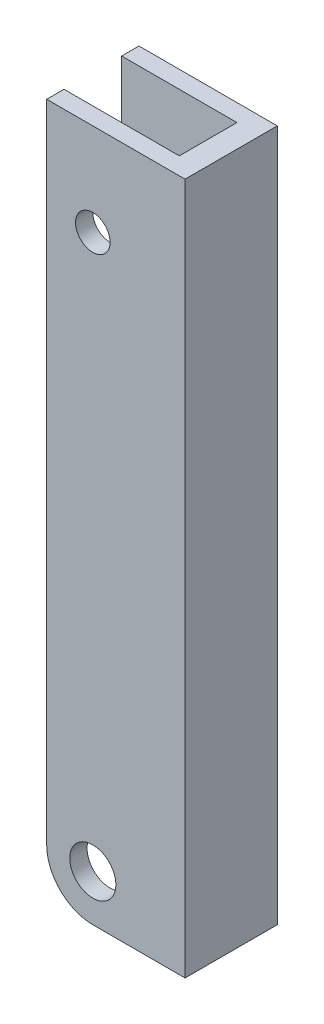
ISO-10303-21;
HEADER;
FILE_DESCRIPTION(('STEP AP214'),'2;1');
FILE_NAME('part.step','',(''),(''),'','','');
FILE_SCHEMA(('AUTOMOTIVE_DESIGN { 1 0 10303 214 1 1 1 1 }'));
ENDSEC;
DATA;
#1=APPLICATION_CONTEXT('core data for automotive mechanical design processes');
#2=APPLICATION_PROTOCOL_DEFINITION('international standard','automotive_design',2000,#1);
#3=PRODUCT_CONTEXT('',#1,'mechanical');
#4=PRODUCT('Part','Part','',(#3));
#5=PRODUCT_RELATED_PRODUCT_CATEGORY('part','',(#4));
#6=PRODUCT_DEFINITION_FORMATION('','',#4);
#7=PRODUCT_DEFINITION_CONTEXT('part definition',#1,'design');
#8=PRODUCT_DEFINITION('design','',#6,#7);
#9=PRODUCT_DEFINITION_SHAPE('','',#8);
#10=(LENGTH_UNIT() NAMED_UNIT(*) SI_UNIT(.MILLI.,.METRE.));
#11=(NAMED_UNIT(*) PLANE_ANGLE_UNIT() SI_UNIT($,.RADIAN.));
#12=(NAMED_UNIT(*) SI_UNIT($,.STERADIAN.) SOLID_ANGLE_UNIT());
#13=UNCERTAINTY_MEASURE_WITH_UNIT(LENGTH_MEASURE(1.E-05),#10,'distance_accuracy_value','');
#14=(GEOMETRIC_REPRESENTATION_CONTEXT(3) GLOBAL_UNCERTAINTY_ASSIGNED_CONTEXT((#13)) GLOBAL_UNIT_ASSIGNED_CONTEXT((#10,
#11,#12)) REPRESENTATION_CONTEXT('',''));
#15=CARTESIAN_POINT('',(0.,0.,0.));
#16=DIRECTION('',(0.,0.,1.));
#17=DIRECTION('',(1.,0.,0.));
#18=AXIS2_PLACEMENT_3D('',#15,#16,#17);
#19=CARTESIAN_POINT('',(172.039586572849,189.65869932881,6.35));
#20=DIRECTION('',(0.,0.,1.));
#21=DIRECTION('',(1.,0.,0.));
#22=AXIS2_PLACEMENT_3D('',#19,#20,#21);
#23=CYLINDRICAL_SURFACE('',#22,2.38125);
#24=CARTESIAN_POINT('',(172.039586572849,189.65869932881,-3.96875));
#25=DIRECTION('',(0.,0.,1.));
#26=DIRECTION('',(1.,0.,0.));
#27=AXIS2_PLACEMENT_3D('',#24,#25,#26);
#28=CIRCLE('',#27,2.38125);
#29=CARTESIAN_POINT('',(174.420836572849,189.65869932881,-3.96875));
#30=VERTEX_POINT('',#29);
#31=EDGE_CURVE('E91',#30,#30,#28,.T.);
#32=ORIENTED_EDGE('',*,*,#31,.T.);
#33=EDGE_LOOP('',(#32));
#34=FACE_BOUND('',#33,.T.);
#35=CARTESIAN_POINT('',(172.039586572849,189.65869932881,-6.35));
#36=DIRECTION('',(0.,0.,1.));
#37=DIRECTION('',(1.,0.,0.));
#38=AXIS2_PLACEMENT_3D('',#35,#36,#37);
#39=CIRCLE('',#38,2.38125);
#40=CARTESIAN_POINT('',(174.420836572849,189.65869932881,-6.35));
#41=VERTEX_POINT('',#40);
#42=EDGE_CURVE('E19',#41,#41,#39,.T.);
#43=ORIENTED_EDGE('',*,*,#42,.F.);
#44=EDGE_LOOP('',(#43));
#45=FACE_BOUND('',#44,.T.);
#46=ADVANCED_FACE('F16',(#34,#45),#23,.F.);
#47=CARTESIAN_POINT('',(172.039586572849,113.45869932881,-6.35));
#48=DIRECTION('',(0.,0.,-1.));
#49=DIRECTION('',(-1.,0.,0.));
#50=AXIS2_PLACEMENT_3D('',#47,#48,#49);
#51=CYLINDRICAL_SURFACE('',#50,3.17500000000001);
#52=CARTESIAN_POINT('',(172.039586572849,113.45869932881,-3.96875));
#53=DIRECTION('',(0.,0.,-1.));
#54=DIRECTION('',(-1.,0.,0.));
#55=AXIS2_PLACEMENT_3D('',#52,#53,#54);
#56=CIRCLE('',#55,3.17500000000001);
#57=CARTESIAN_POINT('',(168.864586572849,113.45869932881,-3.96875));
#58=VERTEX_POINT('',#57);
#59=EDGE_CURVE('E94',#58,#58,#56,.F.);
#60=ORIENTED_EDGE('',*,*,#59,.T.);
#61=EDGE_LOOP('',(#60));
#62=FACE_BOUND('',#61,.T.);
#63=CARTESIAN_POINT('',(172.039586572849,113.45869932881,-6.35));
#64=DIRECTION('',(0.,0.,-1.));
#65=DIRECTION('',(-1.,0.,0.));
#66=AXIS2_PLACEMENT_3D('',#63,#64,#65);
#67=CIRCLE('',#66,3.17500000000001);
#68=CARTESIAN_POINT('',(168.864586572849,113.45869932881,-6.35));
#69=VERTEX_POINT('',#68);
#70=EDGE_CURVE('E83',#69,#69,#67,.F.);
#71=ORIENTED_EDGE('',*,*,#70,.F.);
#72=EDGE_LOOP('',(#71));
#73=FACE_BOUND('',#72,.T.);
#74=ADVANCED_FACE('F104',(#62,#73),#51,.F.);
#75=CARTESIAN_POINT('',(165.689586572849,107.10869932881,6.35));
#76=DIRECTION('',(1.,0.,0.));
#77=DIRECTION('',(0.,0.,-1.));
#78=AXIS2_PLACEMENT_3D('',#75,#76,#77);
#79=PLANE('',#78);
#80=DIRECTION('',(0.,0.,-1.));
#81=VECTOR('',#80,1.);
#82=CARTESIAN_POINT('',(165.689586572849,113.45869932881,6.35));
#83=LINE('',#82,#81);
#84=CARTESIAN_POINT('',(165.689586572849,113.45869932881,-3.96875));
#85=VERTEX_POINT('',#84);
#86=CARTESIAN_POINT('',(165.689586572849,113.45869932881,-6.35));
#87=VERTEX_POINT('',#86);
#88=EDGE_CURVE('E61',#85,#87,#83,.T.);
#89=ORIENTED_EDGE('',*,*,#88,.F.);
#90=DIRECTION('',(0.,1.,0.));
#91=VECTOR('',#90,1.);
#92=CARTESIAN_POINT('',(165.689586572849,202.35869932881,-3.96875));
#93=LINE('',#92,#91);
#94=CARTESIAN_POINT('',(165.689586572849,202.35869932881,-3.96875));
#95=VERTEX_POINT('',#94);
#96=EDGE_CURVE('E273',#85,#95,#93,.T.);
#97=ORIENTED_EDGE('',*,*,#96,.T.);
#98=DIRECTION('',(0.,0.,-1.));
#99=VECTOR('',#98,1.);
#100=CARTESIAN_POINT('',(165.689586572849,202.35869932881,6.35));
#101=LINE('',#100,#99);
#102=CARTESIAN_POINT('',(165.689586572849,202.35869932881,-6.35));
#103=VERTEX_POINT('',#102);
#104=EDGE_CURVE('E79',#95,#103,#101,.T.);
#105=ORIENTED_EDGE('',*,*,#104,.T.);
#106=DIRECTION('',(0.,1.,0.));
#107=VECTOR('',#106,1.);
#108=CARTESIAN_POINT('',(165.689586572849,0.,-6.35));
#109=LINE('',#108,#107);
#110=EDGE_CURVE('E72',#87,#103,#109,.T.);
#111=ORIENTED_EDGE('',*,*,#110,.F.);
#112=EDGE_LOOP('',(#89,#97,#105,#111));
#113=FACE_BOUND('',#112,.T.);
#114=ADVANCED_FACE('F76',(#113),#79,.F.);
#115=CARTESIAN_POINT('',(0.,0.,-6.35));
#116=DIRECTION('',(0.,0.,-1.));
#117=DIRECTION('',(-1.,0.,0.));
#118=AXIS2_PLACEMENT_3D('',#115,#116,#117);
#119=PLANE('',#118);
#120=DIRECTION('',(1.,0.,0.));
#121=VECTOR('',#120,1.);
#122=CARTESIAN_POINT('',(165.689586572849,202.35869932881,-6.35));
#123=LINE('',#122,#121);
#124=CARTESIAN_POINT('',(184.739586572849,202.35869932881,-6.35));
#125=VERTEX_POINT('',#124);
#126=EDGE_CURVE('E306',#103,#125,#123,.T.);
#127=ORIENTED_EDGE('',*,*,#126,.T.);
#128=DIRECTION('',(0.,1.,0.));
#129=VECTOR('',#128,1.);
#130=CARTESIAN_POINT('',(184.739586572849,107.10869932881,-6.35));
#131=LINE('',#130,#129);
#132=CARTESIAN_POINT('',(184.739586572849,107.10869932881,-6.35));
#133=VERTEX_POINT('',#132);
#134=EDGE_CURVE('E319',#125,#133,#131,.F.);
#135=ORIENTED_EDGE('',*,*,#134,.T.);
#136=DIRECTION('',(1.,0.,0.));
#137=VECTOR('',#136,1.);
#138=CARTESIAN_POINT('',(165.689586572849,107.10869932881,-6.35));
#139=LINE('',#138,#137);
#140=CARTESIAN_POINT('',(172.039586572849,107.10869932881,-6.35));
#141=VERTEX_POINT('',#140);
#142=EDGE_CURVE('E90',#133,#141,#139,.F.);
#143=ORIENTED_EDGE('',*,*,#142,.T.);
#144=CARTESIAN_POINT('',(172.039586572849,113.45869932881,-6.35));
#145=DIRECTION('',(0.,0.,-1.));
#146=DIRECTION('',(-1.,0.,0.));
#147=AXIS2_PLACEMENT_3D('',#144,#145,#146);
#148=CIRCLE('',#147,6.34999999999999);
#149=EDGE_CURVE('E66',#87,#141,#148,.F.);
#150=ORIENTED_EDGE('',*,*,#149,.F.);
#151=ORIENTED_EDGE('',*,*,#110,.T.);
#152=EDGE_LOOP('',(#127,#135,#143,#150,#151));
#153=FACE_BOUND('',#152,.T.);
#154=ORIENTED_EDGE('',*,*,#70,.T.);
#155=EDGE_LOOP('',(#154));
#156=FACE_BOUND('',#155,.T.);
#157=ORIENTED_EDGE('',*,*,#42,.T.);
#158=EDGE_LOOP('',(#157));
#159=FACE_BOUND('',#158,.T.);
#160=ADVANCED_FACE('F86',(#153,#156,#159),#119,.T.);
#161=CARTESIAN_POINT('',(172.039586572849,113.45869932881,6.35));
#162=DIRECTION('',(0.,0.,-1.));
#163=DIRECTION('',(-1.,0.,0.));
#164=AXIS2_PLACEMENT_3D('',#161,#162,#163);
#165=CYLINDRICAL_SURFACE('',#164,6.34999999999999);
#166=ORIENTED_EDGE('',*,*,#149,.T.);
#167=DIRECTION('',(0.,0.,1.));
#168=VECTOR('',#167,1.);
#169=CARTESIAN_POINT('',(172.039586572849,107.10869932881,6.35));
#170=LINE('',#169,#168);
#171=CARTESIAN_POINT('',(172.039586572849,107.10869932881,-3.96875));
#172=VERTEX_POINT('',#171);
#173=EDGE_CURVE('E327',#141,#172,#170,.T.);
#174=ORIENTED_EDGE('',*,*,#173,.T.);
#175=CARTESIAN_POINT('',(172.039586572849,113.45869932881,-3.96875));
#176=DIRECTION('',(0.,0.,-1.));
#177=DIRECTION('',(-1.,0.,0.));
#178=AXIS2_PLACEMENT_3D('',#175,#176,#177);
#179=CIRCLE('',#178,6.34999999999999);
#180=EDGE_CURVE('E68',#172,#85,#179,.T.);
#181=ORIENTED_EDGE('',*,*,#180,.T.);
#182=ORIENTED_EDGE('',*,*,#88,.T.);
#183=EDGE_LOOP('',(#166,#174,#181,#182));
#184=FACE_BOUND('',#183,.T.);
#185=ADVANCED_FACE('F63',(#184),#165,.T.);
#186=CARTESIAN_POINT('',(165.689586572849,202.35869932881,-3.96875));
#187=DIRECTION('',(0.,0.,-1.));
#188=DIRECTION('',(-1.,0.,0.));
#189=AXIS2_PLACEMENT_3D('',#186,#187,#188);
#190=PLANE('',#189);
#191=ORIENTED_EDGE('',*,*,#180,.F.);
#192=DIRECTION('',(1.,0.,0.));
#193=VECTOR('',#192,1.);
#194=CARTESIAN_POINT('',(165.689586572849,107.10869932881,-3.96875));
#195=LINE('',#194,#193);
#196=CARTESIAN_POINT('',(181.564586572849,107.10869932881,-3.96875));
#197=VERTEX_POINT('',#196);
#198=EDGE_CURVE('E329',#172,#197,#195,.T.);
#199=ORIENTED_EDGE('',*,*,#198,.T.);
#200=DIRECTION('',(0.,1.,0.));
#201=VECTOR('',#200,1.);
#202=CARTESIAN_POINT('',(181.564586572849,202.35869932881,-3.96875));
#203=LINE('',#202,#201);
#204=CARTESIAN_POINT('',(181.564586572849,202.35869932881,-3.96875));
#205=VERTEX_POINT('',#204);
#206=EDGE_CURVE('E333',#197,#205,#203,.T.);
#207=ORIENTED_EDGE('',*,*,#206,.T.);
#208=DIRECTION('',(1.,0.,0.));
#209=VECTOR('',#208,1.);
#210=CARTESIAN_POINT('',(165.689586572849,202.35869932881,-3.96875));
#211=LINE('',#210,#209);
#212=EDGE_CURVE('E283',#205,#95,#211,.F.);
#213=ORIENTED_EDGE('',*,*,#212,.T.);
#214=ORIENTED_EDGE('',*,*,#96,.F.);
#215=EDGE_LOOP('',(#191,#199,#207,#213,#214));
#216=FACE_BOUND('',#215,.T.);
#217=ORIENTED_EDGE('',*,*,#59,.F.);
#218=EDGE_LOOP('',(#217));
#219=FACE_BOUND('',#218,.T.);
#220=ORIENTED_EDGE('',*,*,#31,.F.);
#221=EDGE_LOOP('',(#220));
#222=FACE_BOUND('',#221,.T.);
#223=ADVANCED_FACE('F155',(#216,#219,#222),#190,.F.);
#224=CARTESIAN_POINT('',(181.564586572849,202.35869932881,-3.96875));
#225=DIRECTION('',(1.,0.,0.));
#226=DIRECTION('',(0.,0.,-1.));
#227=AXIS2_PLACEMENT_3D('',#224,#225,#226);
#228=PLANE('',#227);
#229=DIRECTION('',(0.,1.,0.));
#230=VECTOR('',#229,1.);
#231=CARTESIAN_POINT('',(181.564586572849,202.35869932881,3.96875));
#232=LINE('',#231,#230);
#233=CARTESIAN_POINT('',(181.564586572849,107.10869932881,3.96875));
#234=VERTEX_POINT('',#233);
#235=CARTESIAN_POINT('',(181.564586572849,202.35869932881,3.96875));
#236=VERTEX_POINT('',#235);
#237=EDGE_CURVE('E280',#234,#236,#232,.T.);
#238=ORIENTED_EDGE('',*,*,#237,.T.);
#239=DIRECTION('',(0.,0.,-1.));
#240=VECTOR('',#239,1.);
#241=CARTESIAN_POINT('',(181.564586572849,202.35869932881,6.35));
#242=LINE('',#241,#240);
#243=EDGE_CURVE('E309',#236,#205,#242,.T.);
#244=ORIENTED_EDGE('',*,*,#243,.T.);
#245=ORIENTED_EDGE('',*,*,#206,.F.);
#246=DIRECTION('',(0.,0.,1.));
#247=VECTOR('',#246,1.);
#248=CARTESIAN_POINT('',(181.564586572849,107.10869932881,6.35));
#249=LINE('',#248,#247);
#250=EDGE_CURVE('E337',#197,#234,#249,.T.);
#251=ORIENTED_EDGE('',*,*,#250,.T.);
#252=EDGE_LOOP('',(#238,#244,#245,#251));
#253=FACE_BOUND('',#252,.T.);
#254=ADVANCED_FACE('F151',(#253),#228,.F.);
#255=CARTESIAN_POINT('',(165.689586572849,202.35869932881,3.96875));
#256=DIRECTION('',(0.,0.,1.));
#257=DIRECTION('',(1.,0.,0.));
#258=AXIS2_PLACEMENT_3D('',#255,#256,#257);
#259=PLANE('',#258);
#260=CARTESIAN_POINT('',(172.039586572849,113.45869932881,3.96875));
#261=DIRECTION('',(0.,0.,-1.));
#262=DIRECTION('',(-1.,0.,0.));
#263=AXIS2_PLACEMENT_3D('',#260,#261,#262);
#264=CIRCLE('',#263,6.34999999999999);
#265=CARTESIAN_POINT('',(165.689586572849,113.45869932881,3.96875));
#266=VERTEX_POINT('',#265);
#267=CARTESIAN_POINT('',(172.039586572849,107.10869932881,3.96875));
#268=VERTEX_POINT('',#267);
#269=EDGE_CURVE('E284',#266,#268,#264,.F.);
#270=ORIENTED_EDGE('',*,*,#269,.F.);
#271=DIRECTION('',(0.,1.,0.));
#272=VECTOR('',#271,1.);
#273=CARTESIAN_POINT('',(165.689586572849,107.10869932881,3.96875));
#274=LINE('',#273,#272);
#275=CARTESIAN_POINT('',(165.689586572849,202.35869932881,3.96875));
#276=VERTEX_POINT('',#275);
#277=EDGE_CURVE('E292',#266,#276,#274,.T.);
#278=ORIENTED_EDGE('',*,*,#277,.T.);
#279=DIRECTION('',(1.,0.,0.));
#280=VECTOR('',#279,1.);
#281=CARTESIAN_POINT('',(165.689586572849,202.35869932881,3.96875));
#282=LINE('',#281,#280);
#283=EDGE_CURVE('E313',#276,#236,#282,.T.);
#284=ORIENTED_EDGE('',*,*,#283,.T.);
#285=ORIENTED_EDGE('',*,*,#237,.F.);
#286=DIRECTION('',(1.,0.,0.));
#287=VECTOR('',#286,1.);
#288=CARTESIAN_POINT('',(165.689586572849,107.10869932881,3.96875));
#289=LINE('',#288,#287);
#290=EDGE_CURVE('E287',#234,#268,#289,.F.);
#291=ORIENTED_EDGE('',*,*,#290,.T.);
#292=EDGE_LOOP('',(#270,#278,#284,#285,#291));
#293=FACE_BOUND('',#292,.T.);
#294=CARTESIAN_POINT('',(172.039586572849,113.45869932881,3.96875));
#295=DIRECTION('',(0.,0.,-1.));
#296=DIRECTION('',(-1.,0.,0.));
#297=AXIS2_PLACEMENT_3D('',#294,#295,#296);
#298=CIRCLE('',#297,3.17500000000001);
#299=CARTESIAN_POINT('',(168.864586572849,113.45869932881,3.96875));
#300=VERTEX_POINT('',#299);
#301=EDGE_CURVE('E279',#300,#300,#298,.F.);
#302=ORIENTED_EDGE('',*,*,#301,.T.);
#303=EDGE_LOOP('',(#302));
#304=FACE_BOUND('',#303,.T.);
#305=CARTESIAN_POINT('',(172.039586572849,189.65869932881,3.96875));
#306=DIRECTION('',(0.,0.,1.));
#307=DIRECTION('',(1.,0.,0.));
#308=AXIS2_PLACEMENT_3D('',#305,#306,#307);
#309=CIRCLE('',#308,2.38125);
#310=CARTESIAN_POINT('',(174.420836572849,189.65869932881,3.96875));
#311=VERTEX_POINT('',#310);
#312=EDGE_CURVE('E276',#311,#311,#309,.T.);
#313=ORIENTED_EDGE('',*,*,#312,.T.);
#314=EDGE_LOOP('',(#313));
#315=FACE_BOUND('',#314,.T.);
#316=ADVANCED_FACE('F147',(#293,#304,#315),#259,.F.);
#317=CARTESIAN_POINT('',(172.039586572849,189.65869932881,6.35));
#318=DIRECTION('',(0.,0.,1.));
#319=DIRECTION('',(1.,0.,0.));
#320=AXIS2_PLACEMENT_3D('',#317,#318,#319);
#321=CYLINDRICAL_SURFACE('',#320,2.38125);
#322=ORIENTED_EDGE('',*,*,#312,.F.);
#323=EDGE_LOOP('',(#322));
#324=FACE_BOUND('',#323,.T.);
#325=CARTESIAN_POINT('',(172.039586572849,189.65869932881,6.35));
#326=DIRECTION('',(0.,0.,1.));
#327=DIRECTION('',(1.,0.,0.));
#328=AXIS2_PLACEMENT_3D('',#325,#326,#327);
#329=CIRCLE('',#328,2.38125);
#330=CARTESIAN_POINT('',(174.420836572849,189.65869932881,6.35));
#331=VERTEX_POINT('',#330);
#332=EDGE_CURVE('E288',#331,#331,#329,.T.);
#333=ORIENTED_EDGE('',*,*,#332,.T.);
#334=EDGE_LOOP('',(#333));
#335=FACE_BOUND('',#334,.T.);
#336=ADVANCED_FACE('F143',(#324,#335),#321,.F.);
#337=CARTESIAN_POINT('',(172.039586572849,113.45869932881,-6.35));
#338=DIRECTION('',(0.,0.,-1.));
#339=DIRECTION('',(-1.,0.,0.));
#340=AXIS2_PLACEMENT_3D('',#337,#338,#339);
#341=CYLINDRICAL_SURFACE('',#340,3.17500000000001);
#342=CARTESIAN_POINT('',(172.039586572849,113.45869932881,6.35));
#343=DIRECTION('',(0.,0.,-1.));
#344=DIRECTION('',(-1.,0.,0.));
#345=AXIS2_PLACEMENT_3D('',#342,#343,#344);
#346=CIRCLE('',#345,3.17500000000001);
#347=CARTESIAN_POINT('',(168.864586572849,113.45869932881,6.35));
#348=VERTEX_POINT('',#347);
#349=EDGE_CURVE('E291',#348,#348,#346,.F.);
#350=ORIENTED_EDGE('',*,*,#349,.T.);
#351=EDGE_LOOP('',(#350));
#352=FACE_BOUND('',#351,.T.);
#353=ORIENTED_EDGE('',*,*,#301,.F.);
#354=EDGE_LOOP('',(#353));
#355=FACE_BOUND('',#354,.T.);
#356=ADVANCED_FACE('F139',(#352,#355),#341,.F.);
#357=CARTESIAN_POINT('',(165.689586572849,202.35869932881,6.35));
#358=DIRECTION('',(0.,-1.,0.));
#359=DIRECTION('',(0.,0.,-1.));
#360=AXIS2_PLACEMENT_3D('',#357,#358,#359);
#361=PLANE('',#360);
#362=ORIENTED_EDGE('',*,*,#283,.F.);
#363=DIRECTION('',(0.,0.,-1.));
#364=VECTOR('',#363,1.);
#365=CARTESIAN_POINT('',(165.689586572849,202.35869932881,6.35));
#366=LINE('',#365,#364);
#367=CARTESIAN_POINT('',(165.689586572849,202.35869932881,6.35));
#368=VERTEX_POINT('',#367);
#369=EDGE_CURVE('E376',#276,#368,#366,.F.);
#370=ORIENTED_EDGE('',*,*,#369,.T.);
#371=DIRECTION('',(-1.,0.,0.));
#372=VECTOR('',#371,1.);
#373=CARTESIAN_POINT('',(0.,202.35869932881,6.35));
#374=LINE('',#373,#372);
#375=CARTESIAN_POINT('',(184.739586572849,202.35869932881,6.35));
#376=VERTEX_POINT('',#375);
#377=EDGE_CURVE('E295',#368,#376,#374,.F.);
#378=ORIENTED_EDGE('',*,*,#377,.T.);
#379=DIRECTION('',(0.,0.,1.));
#380=VECTOR('',#379,1.);
#381=CARTESIAN_POINT('',(184.739586572849,202.35869932881,6.35));
#382=LINE('',#381,#380);
#383=EDGE_CURVE('E312',#376,#125,#382,.F.);
#384=ORIENTED_EDGE('',*,*,#383,.T.);
#385=ORIENTED_EDGE('',*,*,#126,.F.);
#386=ORIENTED_EDGE('',*,*,#104,.F.);
#387=ORIENTED_EDGE('',*,*,#212,.F.);
#388=ORIENTED_EDGE('',*,*,#243,.F.);
#389=EDGE_LOOP('',(#362,#370,#378,#384,#385,#386,#387,#388));
#390=FACE_BOUND('',#389,.T.);
#391=ADVANCED_FACE('F135',(#390),#361,.F.);
#392=CARTESIAN_POINT('',(184.739586572849,107.10869932881,6.35));
#393=DIRECTION('',(-1.,0.,0.));
#394=DIRECTION('',(0.,0.,1.));
#395=AXIS2_PLACEMENT_3D('',#392,#393,#394);
#396=PLANE('',#395);
#397=ORIENTED_EDGE('',*,*,#383,.F.);
#398=DIRECTION('',(0.,1.,0.));
#399=VECTOR('',#398,1.);
#400=CARTESIAN_POINT('',(184.739586572849,0.,6.35));
#401=LINE('',#400,#399);
#402=CARTESIAN_POINT('',(184.739586572849,107.10869932881,6.35));
#403=VERTEX_POINT('',#402);
#404=EDGE_CURVE('E368',#376,#403,#401,.F.);
#405=ORIENTED_EDGE('',*,*,#404,.T.);
#406=DIRECTION('',(0.,0.,1.));
#407=VECTOR('',#406,1.);
#408=CARTESIAN_POINT('',(184.739586572849,107.10869932881,6.35));
#409=LINE('',#408,#407);
#410=EDGE_CURVE('E321',#403,#133,#409,.F.);
#411=ORIENTED_EDGE('',*,*,#410,.T.);
#412=ORIENTED_EDGE('',*,*,#134,.F.);
#413=EDGE_LOOP('',(#397,#405,#411,#412));
#414=FACE_BOUND('',#413,.T.);
#415=ADVANCED_FACE('F131',(#414),#396,.F.);
#416=CARTESIAN_POINT('',(165.689586572849,107.10869932881,6.35));
#417=DIRECTION('',(0.,1.,0.));
#418=DIRECTION('',(0.,0.,1.));
#419=AXIS2_PLACEMENT_3D('',#416,#417,#418);
#420=PLANE('',#419);
#421=DIRECTION('',(0.,0.,-1.));
#422=VECTOR('',#421,1.);
#423=CARTESIAN_POINT('',(172.039586572849,107.10869932881,6.35));
#424=LINE('',#423,#422);
#425=CARTESIAN_POINT('',(172.039586572849,107.10869932881,6.35));
#426=VERTEX_POINT('',#425);
#427=EDGE_CURVE('E286',#268,#426,#424,.F.);
#428=ORIENTED_EDGE('',*,*,#427,.F.);
#429=ORIENTED_EDGE('',*,*,#290,.F.);
#430=ORIENTED_EDGE('',*,*,#250,.F.);
#431=ORIENTED_EDGE('',*,*,#198,.F.);
#432=ORIENTED_EDGE('',*,*,#173,.F.);
#433=ORIENTED_EDGE('',*,*,#142,.F.);
#434=ORIENTED_EDGE('',*,*,#410,.F.);
#435=DIRECTION('',(-1.,0.,0.));
#436=VECTOR('',#435,1.);
#437=CARTESIAN_POINT('',(0.,107.10869932881,6.35));
#438=LINE('',#437,#436);
#439=EDGE_CURVE('E297',#403,#426,#438,.T.);
#440=ORIENTED_EDGE('',*,*,#439,.T.);
#441=EDGE_LOOP('',(#428,#429,#430,#431,#432,#433,#434,#440));
#442=FACE_BOUND('',#441,.T.);
#443=ADVANCED_FACE('F127',(#442),#420,.F.);
#444=CARTESIAN_POINT('',(172.039586572849,113.45869932881,6.35));
#445=DIRECTION('',(0.,0.,-1.));
#446=DIRECTION('',(-1.,0.,0.));
#447=AXIS2_PLACEMENT_3D('',#444,#445,#446);
#448=CYLINDRICAL_SURFACE('',#447,6.34999999999999);
#449=ORIENTED_EDGE('',*,*,#269,.T.);
#450=ORIENTED_EDGE('',*,*,#427,.T.);
#451=CARTESIAN_POINT('',(172.039586572849,113.45869932881,6.35));
#452=DIRECTION('',(0.,0.,-1.));
#453=DIRECTION('',(-1.,0.,0.));
#454=AXIS2_PLACEMENT_3D('',#451,#452,#453);
#455=CIRCLE('',#454,6.34999999999999);
#456=CARTESIAN_POINT('',(165.689586572849,113.45869932881,6.35));
#457=VERTEX_POINT('',#456);
#458=EDGE_CURVE('E25',#426,#457,#455,.T.);
#459=ORIENTED_EDGE('',*,*,#458,.T.);
#460=DIRECTION('',(0.,0.,-1.));
#461=VECTOR('',#460,1.);
#462=CARTESIAN_POINT('',(165.689586572849,113.45869932881,6.35));
#463=LINE('',#462,#461);
#464=EDGE_CURVE('E33',#457,#266,#463,.T.);
#465=ORIENTED_EDGE('',*,*,#464,.T.);
#466=EDGE_LOOP('',(#449,#450,#459,#465));
#467=FACE_BOUND('',#466,.T.);
#468=ADVANCED_FACE('F120',(#467),#448,.T.);
#469=CARTESIAN_POINT('',(165.689586572849,107.10869932881,6.35));
#470=DIRECTION('',(1.,0.,0.));
#471=DIRECTION('',(0.,0.,-1.));
#472=AXIS2_PLACEMENT_3D('',#469,#470,#471);
#473=PLANE('',#472);
#474=ORIENTED_EDGE('',*,*,#464,.F.);
#475=DIRECTION('',(0.,1.,0.));
#476=VECTOR('',#475,1.);
#477=CARTESIAN_POINT('',(165.689586572849,0.,6.35));
#478=LINE('',#477,#476);
#479=EDGE_CURVE('E11',#457,#368,#478,.T.);
#480=ORIENTED_EDGE('',*,*,#479,.T.);
#481=ORIENTED_EDGE('',*,*,#369,.F.);
#482=ORIENTED_EDGE('',*,*,#277,.F.);
#483=EDGE_LOOP('',(#474,#480,#481,#482));
#484=FACE_BOUND('',#483,.T.);
#485=ADVANCED_FACE('F113',(#484),#473,.F.);
#486=CARTESIAN_POINT('',(0.,0.,6.35));
#487=DIRECTION('',(0.,0.,-1.));
#488=DIRECTION('',(-1.,0.,0.));
#489=AXIS2_PLACEMENT_3D('',#486,#487,#488);
#490=PLANE('',#489);
#491=ORIENTED_EDGE('',*,*,#458,.F.);
#492=ORIENTED_EDGE('',*,*,#439,.F.);
#493=ORIENTED_EDGE('',*,*,#404,.F.);
#494=ORIENTED_EDGE('',*,*,#377,.F.);
#495=ORIENTED_EDGE('',*,*,#479,.F.);
#496=EDGE_LOOP('',(#491,#492,#493,#494,#495));
#497=FACE_BOUND('',#496,.T.);
#498=ORIENTED_EDGE('',*,*,#349,.F.);
#499=EDGE_LOOP('',(#498));
#500=FACE_BOUND('',#499,.T.);
#501=ORIENTED_EDGE('',*,*,#332,.F.);
#502=EDGE_LOOP('',(#501));
#503=FACE_BOUND('',#502,.T.);
#504=ADVANCED_FACE('F111',(#497,#500,#503),#490,.F.);
#505=CLOSED_SHELL('',(#46,#74,#114,#160,#185,#223,#254,#316,#336,#356,#391,#415,#443,#468,#485,#504));
#506=MANIFOLD_SOLID_BREP('B1',#505);
#507=ADVANCED_BREP_SHAPE_REPRESENTATION('',(#18,#506),#14);
#508=SHAPE_DEFINITION_REPRESENTATION(#9,#507);
ENDSEC;
END-ISO-10303-21;
